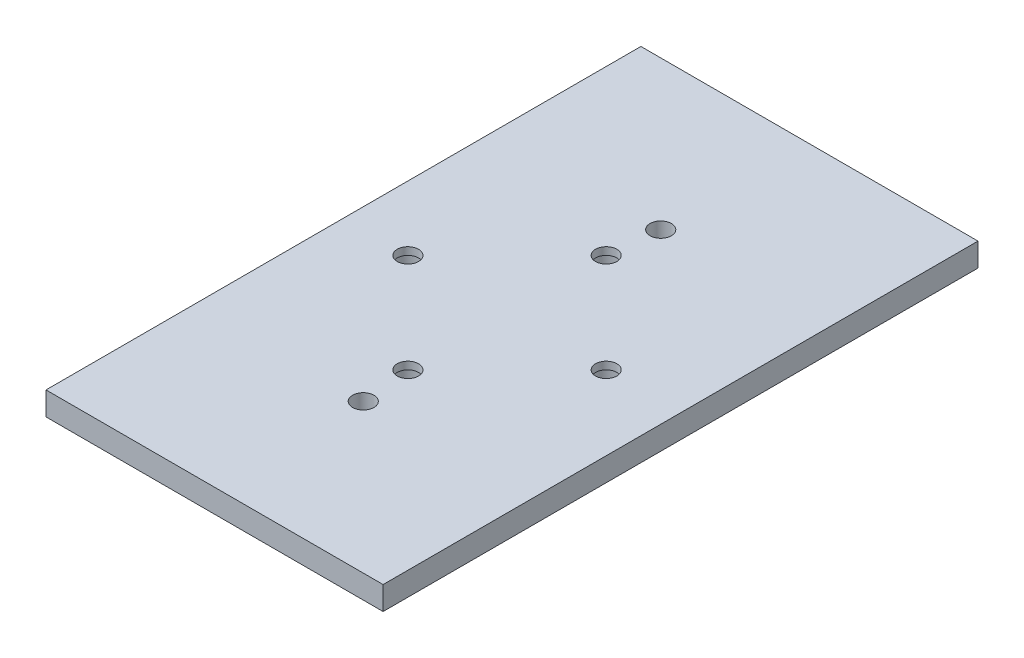
ISO-10303-21;
HEADER;
FILE_DESCRIPTION(('STEP AP214'),'2;1');
FILE_NAME('part.step','',(''),(''),'','','');
FILE_SCHEMA(('AUTOMOTIVE_DESIGN { 1 0 10303 214 1 1 1 1 }'));
ENDSEC;
DATA;
#1=APPLICATION_CONTEXT('core data for automotive mechanical design processes');
#2=APPLICATION_PROTOCOL_DEFINITION('international standard','automotive_design',2000,#1);
#3=PRODUCT_CONTEXT('',#1,'mechanical');
#4=PRODUCT('Part','Part','',(#3));
#5=PRODUCT_RELATED_PRODUCT_CATEGORY('part','',(#4));
#6=PRODUCT_DEFINITION_FORMATION('','',#4);
#7=PRODUCT_DEFINITION_CONTEXT('part definition',#1,'design');
#8=PRODUCT_DEFINITION('design','',#6,#7);
#9=PRODUCT_DEFINITION_SHAPE('','',#8);
#10=(LENGTH_UNIT() NAMED_UNIT(*) SI_UNIT(.MILLI.,.METRE.));
#11=(NAMED_UNIT(*) PLANE_ANGLE_UNIT() SI_UNIT($,.RADIAN.));
#12=(NAMED_UNIT(*) SI_UNIT($,.STERADIAN.) SOLID_ANGLE_UNIT());
#13=UNCERTAINTY_MEASURE_WITH_UNIT(LENGTH_MEASURE(1.E-05),#10,'distance_accuracy_value','');
#14=(GEOMETRIC_REPRESENTATION_CONTEXT(3) GLOBAL_UNCERTAINTY_ASSIGNED_CONTEXT((#13)) GLOBAL_UNIT_ASSIGNED_CONTEXT((#10,
#11,#12)) REPRESENTATION_CONTEXT('',''));
#15=CARTESIAN_POINT('',(0.,0.,0.));
#16=DIRECTION('',(0.,0.,1.));
#17=DIRECTION('',(1.,0.,0.));
#18=AXIS2_PLACEMENT_3D('',#15,#16,#17);
#19=CARTESIAN_POINT('',(44.45,0.,-50.8));
#20=DIRECTION('',(0.,1.,0.));
#21=DIRECTION('',(0.,0.,1.));
#22=AXIS2_PLACEMENT_3D('',#19,#20,#21);
#23=CYLINDRICAL_SURFACE('',#22,2.7305);
#24=CARTESIAN_POINT('',(44.45,5.9944,-50.8));
#25=DIRECTION('',(0.,1.,0.));
#26=DIRECTION('',(0.,0.,1.));
#27=AXIS2_PLACEMENT_3D('',#24,#25,#26);
#28=CIRCLE('',#27,2.7305);
#29=CARTESIAN_POINT('',(44.45,5.9944,-48.0695));
#30=VERTEX_POINT('',#29);
#31=EDGE_CURVE('E121',#30,#30,#28,.T.);
#32=ORIENTED_EDGE('',*,*,#31,.T.);
#33=EDGE_LOOP('',(#32));
#34=FACE_BOUND('',#33,.T.);
#35=CARTESIAN_POINT('',(44.45,4.064,-50.8));
#36=DIRECTION('',(0.,-1.,0.));
#37=DIRECTION('',(0.,0.,-1.));
#38=AXIS2_PLACEMENT_3D('',#35,#36,#37);
#39=CIRCLE('',#38,2.7305);
#40=CARTESIAN_POINT('',(44.45,4.064,-53.5305));
#41=VERTEX_POINT('',#40);
#42=EDGE_CURVE('E41',#41,#41,#39,.F.);
#43=ORIENTED_EDGE('',*,*,#42,.F.);
#44=EDGE_LOOP('',(#43));
#45=FACE_BOUND('',#44,.T.);
#46=ADVANCED_FACE('F37',(#34,#45),#23,.F.);
#47=CARTESIAN_POINT('',(44.45,0.,-101.6));
#48=DIRECTION('',(0.,1.,0.));
#49=DIRECTION('',(0.,0.,1.));
#50=AXIS2_PLACEMENT_3D('',#47,#48,#49);
#51=CYLINDRICAL_SURFACE('',#50,2.7305);
#52=CARTESIAN_POINT('',(44.45,5.9944,-101.6));
#53=DIRECTION('',(0.,1.,0.));
#54=DIRECTION('',(0.,0.,1.));
#55=AXIS2_PLACEMENT_3D('',#52,#53,#54);
#56=CIRCLE('',#55,2.7305);
#57=CARTESIAN_POINT('',(44.45,5.9944,-98.8695));
#58=VERTEX_POINT('',#57);
#59=EDGE_CURVE('E124',#58,#58,#56,.T.);
#60=ORIENTED_EDGE('',*,*,#59,.T.);
#61=EDGE_LOOP('',(#60));
#62=FACE_BOUND('',#61,.T.);
#63=CARTESIAN_POINT('',(44.45,4.064,-101.6));
#64=DIRECTION('',(0.,-1.,0.));
#65=DIRECTION('',(0.,0.,-1.));
#66=AXIS2_PLACEMENT_3D('',#63,#64,#65);
#67=CIRCLE('',#66,2.7305);
#68=CARTESIAN_POINT('',(44.45,4.064,-104.3305));
#69=VERTEX_POINT('',#68);
#70=EDGE_CURVE('E103',#69,#69,#67,.F.);
#71=ORIENTED_EDGE('',*,*,#70,.F.);
#72=EDGE_LOOP('',(#71));
#73=FACE_BOUND('',#72,.T.);
#74=ADVANCED_FACE('F175',(#62,#73),#51,.F.);
#75=CARTESIAN_POINT('',(19.05,0.,-76.2));
#76=DIRECTION('',(0.,1.,0.));
#77=DIRECTION('',(0.,0.,1.));
#78=AXIS2_PLACEMENT_3D('',#75,#76,#77);
#79=CYLINDRICAL_SURFACE('',#78,2.7305);
#80=CARTESIAN_POINT('',(19.05,5.9944,-76.2));
#81=DIRECTION('',(0.,1.,0.));
#82=DIRECTION('',(0.,0.,1.));
#83=AXIS2_PLACEMENT_3D('',#80,#81,#82);
#84=CIRCLE('',#83,2.7305);
#85=CARTESIAN_POINT('',(19.05,5.9944,-73.4695));
#86=VERTEX_POINT('',#85);
#87=EDGE_CURVE('E127',#86,#86,#84,.T.);
#88=ORIENTED_EDGE('',*,*,#87,.T.);
#89=EDGE_LOOP('',(#88));
#90=FACE_BOUND('',#89,.T.);
#91=CARTESIAN_POINT('',(19.05,4.064,-76.2));
#92=DIRECTION('',(0.,-1.,0.));
#93=DIRECTION('',(0.,0.,-1.));
#94=AXIS2_PLACEMENT_3D('',#91,#92,#93);
#95=CIRCLE('',#94,2.7305);
#96=CARTESIAN_POINT('',(19.05,4.064,-78.9305));
#97=VERTEX_POINT('',#96);
#98=EDGE_CURVE('E100',#97,#97,#95,.F.);
#99=ORIENTED_EDGE('',*,*,#98,.F.);
#100=EDGE_LOOP('',(#99));
#101=FACE_BOUND('',#100,.T.);
#102=ADVANCED_FACE('F181',(#90,#101),#79,.F.);
#103=CARTESIAN_POINT('',(69.85,0.,-76.2));
#104=DIRECTION('',(0.,1.,0.));
#105=DIRECTION('',(0.,0.,1.));
#106=AXIS2_PLACEMENT_3D('',#103,#104,#105);
#107=CYLINDRICAL_SURFACE('',#106,2.73050000000002);
#108=CARTESIAN_POINT('',(69.85,5.9944,-76.2));
#109=DIRECTION('',(0.,1.,0.));
#110=DIRECTION('',(0.,0.,1.));
#111=AXIS2_PLACEMENT_3D('',#108,#109,#110);
#112=CIRCLE('',#111,2.73050000000002);
#113=CARTESIAN_POINT('',(69.85,5.9944,-73.4695));
#114=VERTEX_POINT('',#113);
#115=EDGE_CURVE('E130',#114,#114,#112,.T.);
#116=ORIENTED_EDGE('',*,*,#115,.T.);
#117=EDGE_LOOP('',(#116));
#118=FACE_BOUND('',#117,.T.);
#119=CARTESIAN_POINT('',(69.85,4.064,-76.2));
#120=DIRECTION('',(0.,-1.,0.));
#121=DIRECTION('',(0.,0.,-1.));
#122=AXIS2_PLACEMENT_3D('',#119,#120,#121);
#123=CIRCLE('',#122,2.73050000000002);
#124=CARTESIAN_POINT('',(69.85,4.064,-78.9305));
#125=VERTEX_POINT('',#124);
#126=EDGE_CURVE('E97',#125,#125,#123,.F.);
#127=ORIENTED_EDGE('',*,*,#126,.F.);
#128=EDGE_LOOP('',(#127));
#129=FACE_BOUND('',#128,.T.);
#130=ADVANCED_FACE('F200',(#118,#129),#107,.F.);
#131=CARTESIAN_POINT('',(0.,5.9944,0.));
#132=DIRECTION('',(0.,0.,-1.));
#133=DIRECTION('',(-1.,0.,0.));
#134=AXIS2_PLACEMENT_3D('',#131,#132,#133);
#135=PLANE('',#134);
#136=DIRECTION('',(1.,0.,0.));
#137=VECTOR('',#136,1.);
#138=CARTESIAN_POINT('',(0.,5.9944,0.));
#139=LINE('',#138,#137);
#140=CARTESIAN_POINT('',(2.54000000000002,5.9944,0.));
#141=VERTEX_POINT('',#140);
#142=CARTESIAN_POINT('',(88.9,5.9944,0.));
#143=VERTEX_POINT('',#142);
#144=EDGE_CURVE('E82',#141,#143,#139,.T.);
#145=ORIENTED_EDGE('',*,*,#144,.F.);
#146=DIRECTION('',(0.,1.,0.));
#147=VECTOR('',#146,1.);
#148=CARTESIAN_POINT('',(2.54000000000002,0.,0.));
#149=LINE('',#148,#147);
#150=CARTESIAN_POINT('',(2.54000000000002,0.,0.));
#151=VERTEX_POINT('',#150);
#152=EDGE_CURVE('E110',#151,#141,#149,.T.);
#153=ORIENTED_EDGE('',*,*,#152,.F.);
#154=DIRECTION('',(1.,0.,0.));
#155=VECTOR('',#154,1.);
#156=CARTESIAN_POINT('',(0.,0.,0.));
#157=LINE('',#156,#155);
#158=CARTESIAN_POINT('',(88.9,0.,0.));
#159=VERTEX_POINT('',#158);
#160=EDGE_CURVE('E91',#151,#159,#157,.T.);
#161=ORIENTED_EDGE('',*,*,#160,.T.);
#162=DIRECTION('',(0.,-1.,0.));
#163=VECTOR('',#162,1.);
#164=CARTESIAN_POINT('',(88.9,5.9944,0.));
#165=LINE('',#164,#163);
#166=EDGE_CURVE('E11',#143,#159,#165,.T.);
#167=ORIENTED_EDGE('',*,*,#166,.F.);
#168=EDGE_LOOP('',(#145,#153,#161,#167));
#169=FACE_BOUND('',#168,.T.);
#170=ADVANCED_FACE('F39',(#169),#135,.F.);
#171=CARTESIAN_POINT('',(88.9,5.9944,0.));
#172=DIRECTION('',(-1.,0.,0.));
#173=DIRECTION('',(0.,0.,1.));
#174=AXIS2_PLACEMENT_3D('',#171,#172,#173);
#175=PLANE('',#174);
#176=DIRECTION('',(0.,0.,-1.));
#177=VECTOR('',#176,1.);
#178=CARTESIAN_POINT('',(88.9,0.,0.));
#179=LINE('',#178,#177);
#180=CARTESIAN_POINT('',(88.9,0.,-152.4));
#181=VERTEX_POINT('',#180);
#182=EDGE_CURVE('E80',#159,#181,#179,.T.);
#183=ORIENTED_EDGE('',*,*,#182,.T.);
#184=DIRECTION('',(0.,-1.,0.));
#185=VECTOR('',#184,1.);
#186=CARTESIAN_POINT('',(88.9,5.9944,-152.4));
#187=LINE('',#186,#185);
#188=CARTESIAN_POINT('',(88.9,5.9944,-152.4));
#189=VERTEX_POINT('',#188);
#190=EDGE_CURVE('E46',#189,#181,#187,.T.);
#191=ORIENTED_EDGE('',*,*,#190,.F.);
#192=DIRECTION('',(0.,0.,-1.));
#193=VECTOR('',#192,1.);
#194=CARTESIAN_POINT('',(88.9,5.9944,0.));
#195=LINE('',#194,#193);
#196=EDGE_CURVE('E145',#143,#189,#195,.T.);
#197=ORIENTED_EDGE('',*,*,#196,.F.);
#198=ORIENTED_EDGE('',*,*,#166,.T.);
#199=EDGE_LOOP('',(#183,#191,#197,#198));
#200=FACE_BOUND('',#199,.T.);
#201=ADVANCED_FACE('F89',(#200),#175,.F.);
#202=CARTESIAN_POINT('',(0.,5.9944,-152.4));
#203=DIRECTION('',(0.,0.,-1.));
#204=DIRECTION('',(-1.,0.,0.));
#205=AXIS2_PLACEMENT_3D('',#202,#203,#204);
#206=PLANE('',#205);
#207=DIRECTION('',(0.,1.,0.));
#208=VECTOR('',#207,1.);
#209=CARTESIAN_POINT('',(2.54,0.,-152.4));
#210=LINE('',#209,#208);
#211=CARTESIAN_POINT('',(2.54000000000001,0.,-152.4));
#212=VERTEX_POINT('',#211);
#213=CARTESIAN_POINT('',(2.54,5.9944,-152.4));
#214=VERTEX_POINT('',#213);
#215=EDGE_CURVE('E54',#212,#214,#210,.T.);
#216=ORIENTED_EDGE('',*,*,#215,.T.);
#217=DIRECTION('',(1.,0.,0.));
#218=VECTOR('',#217,1.);
#219=CARTESIAN_POINT('',(0.,5.9944,-152.4));
#220=LINE('',#219,#218);
#221=EDGE_CURVE('E62',#214,#189,#220,.T.);
#222=ORIENTED_EDGE('',*,*,#221,.T.);
#223=ORIENTED_EDGE('',*,*,#190,.T.);
#224=DIRECTION('',(1.,0.,0.));
#225=VECTOR('',#224,1.);
#226=CARTESIAN_POINT('',(0.,0.,-152.4));
#227=LINE('',#226,#225);
#228=EDGE_CURVE('E76',#212,#181,#227,.T.);
#229=ORIENTED_EDGE('',*,*,#228,.F.);
#230=EDGE_LOOP('',(#216,#222,#223,#229));
#231=FACE_BOUND('',#230,.T.);
#232=ADVANCED_FACE('F85',(#231),#206,.T.);
#233=CARTESIAN_POINT('',(0.,5.9944,0.));
#234=DIRECTION('',(0.,1.,0.));
#235=DIRECTION('',(0.,0.,1.));
#236=AXIS2_PLACEMENT_3D('',#233,#234,#235);
#237=PLANE('',#236);
#238=DIRECTION('',(0.,0.,-1.));
#239=VECTOR('',#238,1.);
#240=CARTESIAN_POINT('',(2.54000000000002,5.9944,0.));
#241=LINE('',#240,#239);
#242=EDGE_CURVE('E118',#141,#214,#241,.T.);
#243=ORIENTED_EDGE('',*,*,#242,.F.);
#244=ORIENTED_EDGE('',*,*,#144,.T.);
#245=ORIENTED_EDGE('',*,*,#196,.T.);
#246=ORIENTED_EDGE('',*,*,#221,.F.);
#247=EDGE_LOOP('',(#243,#244,#245,#246));
#248=FACE_BOUND('',#247,.T.);
#249=ORIENTED_EDGE('',*,*,#115,.F.);
#250=EDGE_LOOP('',(#249));
#251=FACE_BOUND('',#250,.T.);
#252=ORIENTED_EDGE('',*,*,#87,.F.);
#253=EDGE_LOOP('',(#252));
#254=FACE_BOUND('',#253,.T.);
#255=ORIENTED_EDGE('',*,*,#59,.F.);
#256=EDGE_LOOP('',(#255));
#257=FACE_BOUND('',#256,.T.);
#258=ORIENTED_EDGE('',*,*,#31,.F.);
#259=EDGE_LOOP('',(#258));
#260=FACE_BOUND('',#259,.T.);
#261=CARTESIAN_POINT('',(45.72,5.9944,-114.3));
#262=DIRECTION('',(0.,1.,0.));
#263=DIRECTION('',(0.,0.,1.));
#264=AXIS2_PLACEMENT_3D('',#261,#262,#263);
#265=CIRCLE('',#264,2.7305);
#266=CARTESIAN_POINT('',(45.72,5.9944,-111.5695));
#267=VERTEX_POINT('',#266);
#268=EDGE_CURVE('E136',#267,#267,#265,.T.);
#269=ORIENTED_EDGE('',*,*,#268,.F.);
#270=EDGE_LOOP('',(#269));
#271=FACE_BOUND('',#270,.T.);
#272=CARTESIAN_POINT('',(45.72,5.9944,-38.1));
#273=DIRECTION('',(0.,1.,0.));
#274=DIRECTION('',(0.,0.,1.));
#275=AXIS2_PLACEMENT_3D('',#272,#273,#274);
#276=CIRCLE('',#275,2.7305);
#277=CARTESIAN_POINT('',(45.72,5.9944,-35.3695));
#278=VERTEX_POINT('',#277);
#279=EDGE_CURVE('E139',#278,#278,#276,.T.);
#280=ORIENTED_EDGE('',*,*,#279,.F.);
#281=EDGE_LOOP('',(#280));
#282=FACE_BOUND('',#281,.T.);
#283=ADVANCED_FACE('F148',(#248,#251,#254,#257,#260,#271,#282),#237,.T.);
#284=CARTESIAN_POINT('',(0.,0.,0.));
#285=DIRECTION('',(0.,1.,0.));
#286=DIRECTION('',(0.,0.,1.));
#287=AXIS2_PLACEMENT_3D('',#284,#285,#286);
#288=PLANE('',#287);
#289=CARTESIAN_POINT('',(19.05,0.,-76.2));
#290=DIRECTION('',(0.,-1.,0.));
#291=DIRECTION('',(0.,0.,-1.));
#292=AXIS2_PLACEMENT_3D('',#289,#290,#291);
#293=CIRCLE('',#292,3.683);
#294=CARTESIAN_POINT('',(19.05,0.,-79.883));
#295=VERTEX_POINT('',#294);
#296=EDGE_CURVE('E279',#295,#295,#293,.T.);
#297=ORIENTED_EDGE('',*,*,#296,.F.);
#298=EDGE_LOOP('',(#297));
#299=FACE_BOUND('',#298,.T.);
#300=CARTESIAN_POINT('',(44.45,0.,-50.8));
#301=DIRECTION('',(0.,-1.,0.));
#302=DIRECTION('',(0.,0.,-1.));
#303=AXIS2_PLACEMENT_3D('',#300,#301,#302);
#304=CIRCLE('',#303,3.683);
#305=CARTESIAN_POINT('',(44.45,0.,-54.483));
#306=VERTEX_POINT('',#305);
#307=EDGE_CURVE('E276',#306,#306,#304,.T.);
#308=ORIENTED_EDGE('',*,*,#307,.F.);
#309=EDGE_LOOP('',(#308));
#310=FACE_BOUND('',#309,.T.);
#311=CARTESIAN_POINT('',(69.85,0.,-76.2));
#312=DIRECTION('',(0.,-1.,0.));
#313=DIRECTION('',(0.,0.,-1.));
#314=AXIS2_PLACEMENT_3D('',#311,#312,#313);
#315=CIRCLE('',#314,3.683);
#316=CARTESIAN_POINT('',(69.85,0.,-79.883));
#317=VERTEX_POINT('',#316);
#318=EDGE_CURVE('E268',#317,#317,#315,.T.);
#319=ORIENTED_EDGE('',*,*,#318,.F.);
#320=EDGE_LOOP('',(#319));
#321=FACE_BOUND('',#320,.T.);
#322=CARTESIAN_POINT('',(44.45,0.,-101.6));
#323=DIRECTION('',(0.,-1.,0.));
#324=DIRECTION('',(0.,0.,-1.));
#325=AXIS2_PLACEMENT_3D('',#322,#323,#324);
#326=CIRCLE('',#325,3.683);
#327=CARTESIAN_POINT('',(44.45,0.,-105.283));
#328=VERTEX_POINT('',#327);
#329=EDGE_CURVE('E262',#328,#328,#326,.T.);
#330=ORIENTED_EDGE('',*,*,#329,.F.);
#331=EDGE_LOOP('',(#330));
#332=FACE_BOUND('',#331,.T.);
#333=CARTESIAN_POINT('',(45.72,0.,-114.3));
#334=DIRECTION('',(0.,1.,0.));
#335=DIRECTION('',(0.,0.,1.));
#336=AXIS2_PLACEMENT_3D('',#333,#334,#335);
#337=CIRCLE('',#336,2.7305);
#338=CARTESIAN_POINT('',(45.72,0.,-111.5695));
#339=VERTEX_POINT('',#338);
#340=EDGE_CURVE('E93',#339,#339,#337,.T.);
#341=ORIENTED_EDGE('',*,*,#340,.T.);
#342=EDGE_LOOP('',(#341));
#343=FACE_BOUND('',#342,.T.);
#344=CARTESIAN_POINT('',(45.72,0.,-38.1));
#345=DIRECTION('',(0.,1.,0.));
#346=DIRECTION('',(0.,0.,1.));
#347=AXIS2_PLACEMENT_3D('',#344,#345,#346);
#348=CIRCLE('',#347,2.7305);
#349=CARTESIAN_POINT('',(45.72,0.,-35.3695));
#350=VERTEX_POINT('',#349);
#351=EDGE_CURVE('E133',#350,#350,#348,.T.);
#352=ORIENTED_EDGE('',*,*,#351,.T.);
#353=EDGE_LOOP('',(#352));
#354=FACE_BOUND('',#353,.T.);
#355=ORIENTED_EDGE('',*,*,#160,.F.);
#356=DIRECTION('',(0.,0.,-1.));
#357=VECTOR('',#356,1.);
#358=CARTESIAN_POINT('',(2.54,0.,-152.4));
#359=LINE('',#358,#357);
#360=EDGE_CURVE('E81',#151,#212,#359,.T.);
#361=ORIENTED_EDGE('',*,*,#360,.T.);
#362=ORIENTED_EDGE('',*,*,#228,.T.);
#363=ORIENTED_EDGE('',*,*,#182,.F.);
#364=EDGE_LOOP('',(#355,#361,#362,#363));
#365=FACE_BOUND('',#364,.T.);
#366=ADVANCED_FACE('F78',(#299,#310,#321,#332,#343,#354,#365),#288,.F.);
#367=CARTESIAN_POINT('',(45.72,0.,-38.1));
#368=DIRECTION('',(0.,1.,0.));
#369=DIRECTION('',(0.,0.,1.));
#370=AXIS2_PLACEMENT_3D('',#367,#368,#369);
#371=CYLINDRICAL_SURFACE('',#370,2.7305);
#372=ORIENTED_EDGE('',*,*,#351,.F.);
#373=EDGE_LOOP('',(#372));
#374=FACE_BOUND('',#373,.T.);
#375=ORIENTED_EDGE('',*,*,#279,.T.);
#376=EDGE_LOOP('',(#375));
#377=FACE_BOUND('',#376,.T.);
#378=ADVANCED_FACE('F169',(#374,#377),#371,.F.);
#379=CARTESIAN_POINT('',(45.72,0.,-114.3));
#380=DIRECTION('',(0.,1.,0.));
#381=DIRECTION('',(0.,0.,1.));
#382=AXIS2_PLACEMENT_3D('',#379,#380,#381);
#383=CYLINDRICAL_SURFACE('',#382,2.7305);
#384=ORIENTED_EDGE('',*,*,#340,.F.);
#385=EDGE_LOOP('',(#384));
#386=FACE_BOUND('',#385,.T.);
#387=ORIENTED_EDGE('',*,*,#268,.T.);
#388=EDGE_LOOP('',(#387));
#389=FACE_BOUND('',#388,.T.);
#390=ADVANCED_FACE('F160',(#386,#389),#383,.F.);
#391=CARTESIAN_POINT('',(2.54,0.,-152.4));
#392=DIRECTION('',(1.,0.,0.));
#393=DIRECTION('',(0.,0.,-1.));
#394=AXIS2_PLACEMENT_3D('',#391,#392,#393);
#395=PLANE('',#394);
#396=ORIENTED_EDGE('',*,*,#242,.T.);
#397=ORIENTED_EDGE('',*,*,#215,.F.);
#398=ORIENTED_EDGE('',*,*,#360,.F.);
#399=ORIENTED_EDGE('',*,*,#152,.T.);
#400=EDGE_LOOP('',(#396,#397,#398,#399));
#401=FACE_BOUND('',#400,.T.);
#402=ADVANCED_FACE('F157',(#401),#395,.F.);
#403=CARTESIAN_POINT('',(69.85,4.064,-76.2));
#404=DIRECTION('',(0.,-1.,0.));
#405=DIRECTION('',(0.,0.,-1.));
#406=AXIS2_PLACEMENT_3D('',#403,#404,#405);
#407=PLANE('',#406);
#408=CARTESIAN_POINT('',(69.85,4.064,-76.2));
#409=DIRECTION('',(0.,-1.,0.));
#410=DIRECTION('',(0.,0.,-1.));
#411=AXIS2_PLACEMENT_3D('',#408,#409,#410);
#412=CIRCLE('',#411,3.683);
#413=CARTESIAN_POINT('',(69.85,4.064,-79.883));
#414=VERTEX_POINT('',#413);
#415=EDGE_CURVE('E264',#414,#414,#412,.T.);
#416=ORIENTED_EDGE('',*,*,#415,.T.);
#417=EDGE_LOOP('',(#416));
#418=FACE_BOUND('',#417,.T.);
#419=ORIENTED_EDGE('',*,*,#126,.T.);
#420=EDGE_LOOP('',(#419));
#421=FACE_BOUND('',#420,.T.);
#422=ADVANCED_FACE('F159',(#418,#421),#407,.T.);
#423=CARTESIAN_POINT('',(69.85,4.064,-76.2));
#424=DIRECTION('',(0.,-1.,0.));
#425=DIRECTION('',(0.,0.,-1.));
#426=AXIS2_PLACEMENT_3D('',#423,#424,#425);
#427=CYLINDRICAL_SURFACE('',#426,3.683);
#428=ORIENTED_EDGE('',*,*,#415,.F.);
#429=EDGE_LOOP('',(#428));
#430=FACE_BOUND('',#429,.T.);
#431=ORIENTED_EDGE('',*,*,#318,.T.);
#432=EDGE_LOOP('',(#431));
#433=FACE_BOUND('',#432,.T.);
#434=ADVANCED_FACE('F166',(#430,#433),#427,.F.);
#435=CARTESIAN_POINT('',(19.05,4.064,-76.2));
#436=DIRECTION('',(0.,-1.,0.));
#437=DIRECTION('',(0.,0.,-1.));
#438=AXIS2_PLACEMENT_3D('',#435,#436,#437);
#439=PLANE('',#438);
#440=CARTESIAN_POINT('',(19.05,4.064,-76.2));
#441=DIRECTION('',(0.,-1.,0.));
#442=DIRECTION('',(0.,0.,-1.));
#443=AXIS2_PLACEMENT_3D('',#440,#441,#442);
#444=CIRCLE('',#443,3.683);
#445=CARTESIAN_POINT('',(19.05,4.064,-79.883));
#446=VERTEX_POINT('',#445);
#447=EDGE_CURVE('E101',#446,#446,#444,.T.);
#448=ORIENTED_EDGE('',*,*,#447,.T.);
#449=EDGE_LOOP('',(#448));
#450=FACE_BOUND('',#449,.T.);
#451=ORIENTED_EDGE('',*,*,#98,.T.);
#452=EDGE_LOOP('',(#451));
#453=FACE_BOUND('',#452,.T.);
#454=ADVANCED_FACE('F229',(#450,#453),#439,.T.);
#455=CARTESIAN_POINT('',(19.05,4.064,-76.2));
#456=DIRECTION('',(0.,-1.,0.));
#457=DIRECTION('',(0.,0.,-1.));
#458=AXIS2_PLACEMENT_3D('',#455,#456,#457);
#459=CYLINDRICAL_SURFACE('',#458,3.683);
#460=ORIENTED_EDGE('',*,*,#447,.F.);
#461=EDGE_LOOP('',(#460));
#462=FACE_BOUND('',#461,.T.);
#463=ORIENTED_EDGE('',*,*,#296,.T.);
#464=EDGE_LOOP('',(#463));
#465=FACE_BOUND('',#464,.T.);
#466=ADVANCED_FACE('F231',(#462,#465),#459,.F.);
#467=CARTESIAN_POINT('',(44.45,4.064,-101.6));
#468=DIRECTION('',(0.,-1.,0.));
#469=DIRECTION('',(0.,0.,-1.));
#470=AXIS2_PLACEMENT_3D('',#467,#468,#469);
#471=PLANE('',#470);
#472=CARTESIAN_POINT('',(44.45,4.064,-101.6));
#473=DIRECTION('',(0.,-1.,0.));
#474=DIRECTION('',(0.,0.,-1.));
#475=AXIS2_PLACEMENT_3D('',#472,#473,#474);
#476=CIRCLE('',#475,3.683);
#477=CARTESIAN_POINT('',(44.45,4.064,-105.283));
#478=VERTEX_POINT('',#477);
#479=EDGE_CURVE('E116',#478,#478,#476,.T.);
#480=ORIENTED_EDGE('',*,*,#479,.T.);
#481=EDGE_LOOP('',(#480));
#482=FACE_BOUND('',#481,.T.);
#483=ORIENTED_EDGE('',*,*,#70,.T.);
#484=EDGE_LOOP('',(#483));
#485=FACE_BOUND('',#484,.T.);
#486=ADVANCED_FACE('F238',(#482,#485),#471,.T.);
#487=CARTESIAN_POINT('',(44.45,4.064,-101.6));
#488=DIRECTION('',(0.,-1.,0.));
#489=DIRECTION('',(0.,0.,-1.));
#490=AXIS2_PLACEMENT_3D('',#487,#488,#489);
#491=CYLINDRICAL_SURFACE('',#490,3.683);
#492=ORIENTED_EDGE('',*,*,#479,.F.);
#493=EDGE_LOOP('',(#492));
#494=FACE_BOUND('',#493,.T.);
#495=ORIENTED_EDGE('',*,*,#329,.T.);
#496=EDGE_LOOP('',(#495));
#497=FACE_BOUND('',#496,.T.);
#498=ADVANCED_FACE('F251',(#494,#497),#491,.F.);
#499=CARTESIAN_POINT('',(44.45,4.064,-50.8));
#500=DIRECTION('',(0.,-1.,0.));
#501=DIRECTION('',(0.,0.,-1.));
#502=AXIS2_PLACEMENT_3D('',#499,#500,#501);
#503=PLANE('',#502);
#504=CARTESIAN_POINT('',(44.45,4.064,-50.8));
#505=DIRECTION('',(0.,-1.,0.));
#506=DIRECTION('',(0.,0.,-1.));
#507=AXIS2_PLACEMENT_3D('',#504,#505,#506);
#508=CIRCLE('',#507,3.683);
#509=CARTESIAN_POINT('',(44.45,4.064,-54.483));
#510=VERTEX_POINT('',#509);
#511=EDGE_CURVE('E273',#510,#510,#508,.T.);
#512=ORIENTED_EDGE('',*,*,#511,.T.);
#513=EDGE_LOOP('',(#512));
#514=FACE_BOUND('',#513,.T.);
#515=ORIENTED_EDGE('',*,*,#42,.T.);
#516=EDGE_LOOP('',(#515));
#517=FACE_BOUND('',#516,.T.);
#518=ADVANCED_FACE('F248',(#514,#517),#503,.T.);
#519=CARTESIAN_POINT('',(44.45,4.064,-50.8));
#520=DIRECTION('',(0.,-1.,0.));
#521=DIRECTION('',(0.,0.,-1.));
#522=AXIS2_PLACEMENT_3D('',#519,#520,#521);
#523=CYLINDRICAL_SURFACE('',#522,3.683);
#524=ORIENTED_EDGE('',*,*,#511,.F.);
#525=EDGE_LOOP('',(#524));
#526=FACE_BOUND('',#525,.T.);
#527=ORIENTED_EDGE('',*,*,#307,.T.);
#528=EDGE_LOOP('',(#527));
#529=FACE_BOUND('',#528,.T.);
#530=ADVANCED_FACE('F245',(#526,#529),#523,.F.);
#531=CLOSED_SHELL('',(#46,#74,#102,#130,#170,#201,#232,#283,#366,#378,#390,#402,#422,#434,#454,
#466,#486,#498,#518,#530));
#532=MANIFOLD_SOLID_BREP('B2',#531);
#533=ADVANCED_BREP_SHAPE_REPRESENTATION('',(#18,#532),#14);
#534=SHAPE_DEFINITION_REPRESENTATION(#9,#533);
ENDSEC;
END-ISO-10303-21;
